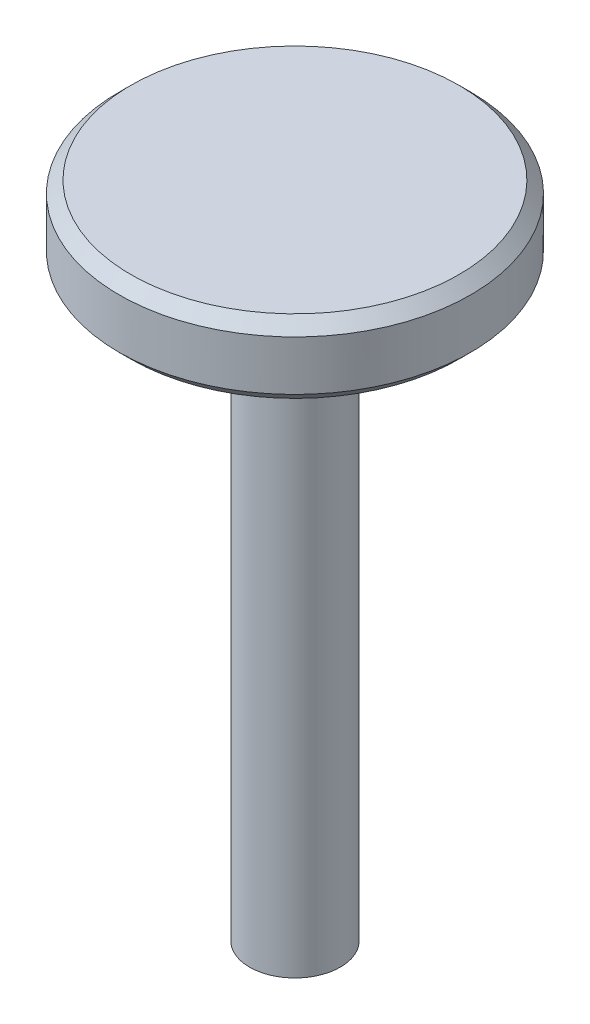
ISO-10303-21;
HEADER;
FILE_DESCRIPTION(('STEP AP214'),'2;1');
FILE_NAME('part.step','',(''),(''),'','','');
FILE_SCHEMA(('AUTOMOTIVE_DESIGN { 1 0 10303 214 1 1 1 1 }'));
ENDSEC;
DATA;
#1=APPLICATION_CONTEXT('core data for automotive mechanical design processes');
#2=APPLICATION_PROTOCOL_DEFINITION('international standard','automotive_design',2000,#1);
#3=PRODUCT_CONTEXT('',#1,'mechanical');
#4=PRODUCT('Part','Part','',(#3));
#5=PRODUCT_RELATED_PRODUCT_CATEGORY('part','',(#4));
#6=PRODUCT_DEFINITION_FORMATION('','',#4);
#7=PRODUCT_DEFINITION_CONTEXT('part definition',#1,'design');
#8=PRODUCT_DEFINITION('design','',#6,#7);
#9=PRODUCT_DEFINITION_SHAPE('','',#8);
#10=(LENGTH_UNIT() NAMED_UNIT(*) SI_UNIT(.MILLI.,.METRE.));
#11=(NAMED_UNIT(*) PLANE_ANGLE_UNIT() SI_UNIT($,.RADIAN.));
#12=(NAMED_UNIT(*) SI_UNIT($,.STERADIAN.) SOLID_ANGLE_UNIT());
#13=UNCERTAINTY_MEASURE_WITH_UNIT(LENGTH_MEASURE(1.E-05),#10,'distance_accuracy_value','');
#14=(GEOMETRIC_REPRESENTATION_CONTEXT(3) GLOBAL_UNCERTAINTY_ASSIGNED_CONTEXT((#13)) GLOBAL_UNIT_ASSIGNED_CONTEXT((#10,
#11,#12)) REPRESENTATION_CONTEXT('',''));
#15=CARTESIAN_POINT('',(0.,0.,0.));
#16=DIRECTION('',(0.,0.,1.));
#17=DIRECTION('',(1.,0.,0.));
#18=AXIS2_PLACEMENT_3D('',#15,#16,#17);
#19=CARTESIAN_POINT('',(-8.49999277070873,28.7004437802323,-106.246990075045));
#20=DIRECTION('',(0.,-1.,1.0071112731931E-13));
#21=DIRECTION('',(0.,-1.0071112731931E-13,-1.));
#22=AXIS2_PLACEMENT_3D('',#19,#20,#21);
#23=PLANE('',#22);
#24=CARTESIAN_POINT('',(-8.49999277070873,28.700443780366,-106.246990075045));
#25=DIRECTION('',(0.,-1.,0.));
#26=DIRECTION('',(0.,0.,-1.));
#27=AXIS2_PLACEMENT_3D('',#24,#25,#26);
#28=CIRCLE('',#27,5.599999999788);
#29=CARTESIAN_POINT('',(-8.49999277070873,28.7004437803655,-111.846990074833));
#30=VERTEX_POINT('',#29);
#31=EDGE_CURVE('E18',#30,#30,#28,.T.);
#32=ORIENTED_EDGE('',*,*,#31,.F.);
#33=EDGE_LOOP('',(#32));
#34=FACE_BOUND('',#33,.T.);
#35=ADVANCED_FACE('F15',(#34),#23,.F.);
#36=CARTESIAN_POINT('',(-8.49999277070873,28.3004437803811,-106.246990075045));
#37=DIRECTION('',(0.,-1.,0.));
#38=DIRECTION('',(0.,0.,-1.));
#39=AXIS2_PLACEMENT_3D('',#36,#37,#38);
#40=CONICAL_SURFACE('',#39,5.99999999977291,0.785398163397455);
#41=CARTESIAN_POINT('',(-8.49999277070873,28.3004437802323,-106.246990075044));
#42=DIRECTION('',(0.,-1.,0.));
#43=DIRECTION('',(0.,0.,-1.));
#44=AXIS2_PLACEMENT_3D('',#41,#42,#43);
#45=CIRCLE('',#44,6.00000000000001);
#46=CARTESIAN_POINT('',(-8.49999277070873,28.3004437802317,-112.246990075044));
#47=VERTEX_POINT('',#46);
#48=EDGE_CURVE('E36',#47,#47,#45,.T.);
#49=ORIENTED_EDGE('',*,*,#48,.F.);
#50=EDGE_LOOP('',(#49));
#51=FACE_BOUND('',#50,.T.);
#52=ORIENTED_EDGE('',*,*,#31,.T.);
#53=EDGE_LOOP('',(#52));
#54=FACE_BOUND('',#53,.T.);
#55=ADVANCED_FACE('F45',(#51,#54),#40,.T.);
#56=CARTESIAN_POINT('',(-8.49999277070872,26.2004437802323,-106.246990075044));
#57=DIRECTION('',(0.,-1.,0.));
#58=DIRECTION('',(0.,0.,-1.));
#59=AXIS2_PLACEMENT_3D('',#56,#57,#58);
#60=CYLINDRICAL_SURFACE('',#59,6.00000000000001);
#61=CARTESIAN_POINT('',(-8.49999277070872,26.6004437802394,-106.246990075044));
#62=DIRECTION('',(0.,1.,0.));
#63=DIRECTION('',(-1.,0.,0.));
#64=AXIS2_PLACEMENT_3D('',#61,#62,#63);
#65=CIRCLE('',#64,5.99999999994345);
#66=CARTESIAN_POINT('',(-14.4999927706522,26.6004437802394,-106.246990075044));
#67=VERTEX_POINT('',#66);
#68=EDGE_CURVE('E30',#67,#67,#65,.F.);
#69=ORIENTED_EDGE('',*,*,#68,.F.);
#70=EDGE_LOOP('',(#69));
#71=FACE_BOUND('',#70,.T.);
#72=ORIENTED_EDGE('',*,*,#48,.T.);
#73=EDGE_LOOP('',(#72));
#74=FACE_BOUND('',#73,.T.);
#75=ADVANCED_FACE('F52',(#71,#74),#60,.T.);
#76=CARTESIAN_POINT('',(-8.49999277070872,26.60044378041,-106.246990075044));
#77=DIRECTION('',(0.,1.,0.));
#78=DIRECTION('',(0.,0.,1.));
#79=AXIS2_PLACEMENT_3D('',#76,#77,#78);
#80=CONICAL_SURFACE('',#79,6.00000000011398,0.785398163397442);
#81=CARTESIAN_POINT('',(-8.49999277070872,26.200443780283,-106.246990075044));
#82=DIRECTION('',(0.,1.,0.));
#83=DIRECTION('',(0.,0.,1.));
#84=AXIS2_PLACEMENT_3D('',#81,#82,#83);
#85=CIRCLE('',#84,5.59999999998699);
#86=CARTESIAN_POINT('',(-8.49999277070872,26.2004437802835,-100.646990075057));
#87=VERTEX_POINT('',#86);
#88=EDGE_CURVE('E27',#87,#87,#85,.F.);
#89=ORIENTED_EDGE('',*,*,#88,.F.);
#90=EDGE_LOOP('',(#89));
#91=FACE_BOUND('',#90,.T.);
#92=ORIENTED_EDGE('',*,*,#68,.T.);
#93=EDGE_LOOP('',(#92));
#94=FACE_BOUND('',#93,.T.);
#95=ADVANCED_FACE('F68',(#91,#94),#80,.T.);
#96=CARTESIAN_POINT('',(-8.49999277070864,6.20044378023227,-106.246990075042));
#97=DIRECTION('',(0.,-1.,1.0071112731931E-13));
#98=DIRECTION('',(0.,-1.0071112731931E-13,-1.));
#99=AXIS2_PLACEMENT_3D('',#96,#97,#98);
#100=PLANE('',#99);
#101=CARTESIAN_POINT('',(-8.49999277070864,6.20044378023226,-106.246990075042));
#102=DIRECTION('',(0.,1.,-1.00364161426114E-13));
#103=DIRECTION('',(0.,1.00364161426114E-13,1.));
#104=AXIS2_PLACEMENT_3D('',#101,#102,#103);
#105=CIRCLE('',#104,1.55024047358084);
#106=CARTESIAN_POINT('',(-8.49999277070864,6.20044378023242,-104.696749601461));
#107=VERTEX_POINT('',#106);
#108=EDGE_CURVE('E22',#107,#107,#105,.T.);
#109=ORIENTED_EDGE('',*,*,#108,.F.);
#110=EDGE_LOOP('',(#109));
#111=FACE_BOUND('',#110,.T.);
#112=ADVANCED_FACE('F61',(#111),#100,.T.);
#113=CARTESIAN_POINT('',(-8.49999277070872,26.2004437802323,-106.246990075044));
#114=DIRECTION('',(0.,-1.,1.0071112731931E-13));
#115=DIRECTION('',(0.,-1.0071112731931E-13,-1.));
#116=AXIS2_PLACEMENT_3D('',#113,#114,#115);
#117=PLANE('',#116);
#118=CARTESIAN_POINT('',(-8.49999277070872,26.2004437802323,-106.246990075044));
#119=DIRECTION('',(0.,1.,-1.00364161426114E-13));
#120=DIRECTION('',(0.,1.00364161426114E-13,1.));
#121=AXIS2_PLACEMENT_3D('',#118,#119,#120);
#122=CIRCLE('',#121,1.55024047358084);
#123=CARTESIAN_POINT('',(-8.49999277070872,26.2004437802324,-104.696749601463));
#124=VERTEX_POINT('',#123);
#125=EDGE_CURVE('E10',#124,#124,#122,.F.);
#126=ORIENTED_EDGE('',*,*,#125,.F.);
#127=EDGE_LOOP('',(#126));
#128=FACE_BOUND('',#127,.T.);
#129=ORIENTED_EDGE('',*,*,#88,.T.);
#130=EDGE_LOOP('',(#129));
#131=FACE_BOUND('',#130,.T.);
#132=ADVANCED_FACE('F56',(#128,#131),#117,.T.);
#133=CARTESIAN_POINT('',(-8.49999277070872,26.2004437802323,-106.246990075044));
#134=DIRECTION('',(0.,1.,-1.00364161426114E-13));
#135=DIRECTION('',(0.,1.00364161426114E-13,1.));
#136=AXIS2_PLACEMENT_3D('',#133,#134,#135);
#137=CYLINDRICAL_SURFACE('',#136,1.55024047358084);
#138=ORIENTED_EDGE('',*,*,#125,.T.);
#139=EDGE_LOOP('',(#138));
#140=FACE_BOUND('',#139,.T.);
#141=ORIENTED_EDGE('',*,*,#108,.T.);
#142=EDGE_LOOP('',(#141));
#143=FACE_BOUND('',#142,.T.);
#144=ADVANCED_FACE('F54',(#140,#143),#137,.T.);
#145=CLOSED_SHELL('',(#35,#55,#75,#95,#112,#132,#144));
#146=MANIFOLD_SOLID_BREP('B1',#145);
#147=ADVANCED_BREP_SHAPE_REPRESENTATION('',(#18,#146),#14);
#148=SHAPE_DEFINITION_REPRESENTATION(#9,#147);
ENDSEC;
END-ISO-10303-21;
